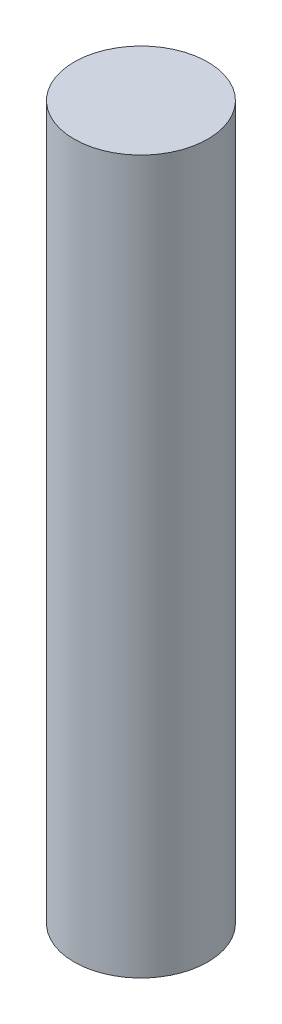
ISO-10303-21;
HEADER;
FILE_DESCRIPTION(('STEP AP214'),'2;1');
FILE_NAME('part.step','',(''),(''),'','','');
FILE_SCHEMA(('AUTOMOTIVE_DESIGN { 1 0 10303 214 1 1 1 1 }'));
ENDSEC;
DATA;
#1=APPLICATION_CONTEXT('core data for automotive mechanical design processes');
#2=APPLICATION_PROTOCOL_DEFINITION('international standard','automotive_design',2000,#1);
#3=PRODUCT_CONTEXT('',#1,'mechanical');
#4=PRODUCT('Part','Part','',(#3));
#5=PRODUCT_RELATED_PRODUCT_CATEGORY('part','',(#4));
#6=PRODUCT_DEFINITION_FORMATION('','',#4);
#7=PRODUCT_DEFINITION_CONTEXT('part definition',#1,'design');
#8=PRODUCT_DEFINITION('design','',#6,#7);
#9=PRODUCT_DEFINITION_SHAPE('','',#8);
#10=(LENGTH_UNIT() NAMED_UNIT(*) SI_UNIT(.MILLI.,.METRE.));
#11=(NAMED_UNIT(*) PLANE_ANGLE_UNIT() SI_UNIT($,.RADIAN.));
#12=(NAMED_UNIT(*) SI_UNIT($,.STERADIAN.) SOLID_ANGLE_UNIT());
#13=UNCERTAINTY_MEASURE_WITH_UNIT(LENGTH_MEASURE(1.E-05),#10,'distance_accuracy_value','');
#14=(GEOMETRIC_REPRESENTATION_CONTEXT(3) GLOBAL_UNCERTAINTY_ASSIGNED_CONTEXT((#13)) GLOBAL_UNIT_ASSIGNED_CONTEXT((#10,
#11,#12)) REPRESENTATION_CONTEXT('',''));
#15=CARTESIAN_POINT('',(0.,0.,0.));
#16=DIRECTION('',(0.,0.,1.));
#17=DIRECTION('',(1.,0.,0.));
#18=AXIS2_PLACEMENT_3D('',#15,#16,#17);
#19=CARTESIAN_POINT('',(0.,50.8,0.));
#20=DIRECTION('',(0.,-1.,0.));
#21=DIRECTION('',(0.,0.,-1.));
#22=AXIS2_PLACEMENT_3D('',#19,#20,#21);
#23=CYLINDRICAL_SURFACE('',#22,4.7625);
#24=CARTESIAN_POINT('',(0.,50.8,0.));
#25=DIRECTION('',(0.,1.,0.));
#26=DIRECTION('',(0.,0.,1.));
#27=AXIS2_PLACEMENT_3D('',#24,#25,#26);
#28=CIRCLE('',#27,4.7625);
#29=CARTESIAN_POINT('',(0.,50.8,4.7625));
#30=VERTEX_POINT('',#29);
#31=EDGE_CURVE('E10',#30,#30,#28,.T.);
#32=ORIENTED_EDGE('',*,*,#31,.F.);
#33=EDGE_LOOP('',(#32));
#34=FACE_BOUND('',#33,.T.);
#35=CARTESIAN_POINT('',(0.,0.,0.));
#36=DIRECTION('',(0.,1.,0.));
#37=DIRECTION('',(0.,0.,1.));
#38=AXIS2_PLACEMENT_3D('',#35,#36,#37);
#39=CIRCLE('',#38,4.7625);
#40=CARTESIAN_POINT('',(0.,0.,4.7625));
#41=VERTEX_POINT('',#40);
#42=EDGE_CURVE('E34',#41,#41,#39,.T.);
#43=ORIENTED_EDGE('',*,*,#42,.T.);
#44=EDGE_LOOP('',(#43));
#45=FACE_BOUND('',#44,.T.);
#46=ADVANCED_FACE('F31',(#34,#45),#23,.T.);
#47=CARTESIAN_POINT('',(0.,50.8,0.));
#48=DIRECTION('',(0.,1.,0.));
#49=DIRECTION('',(0.,0.,1.));
#50=AXIS2_PLACEMENT_3D('',#47,#48,#49);
#51=PLANE('',#50);
#52=ORIENTED_EDGE('',*,*,#31,.T.);
#53=EDGE_LOOP('',(#52));
#54=FACE_BOUND('',#53,.T.);
#55=ADVANCED_FACE('F46',(#54),#51,.T.);
#56=CARTESIAN_POINT('',(0.,0.,0.));
#57=DIRECTION('',(0.,1.,0.));
#58=DIRECTION('',(0.,0.,1.));
#59=AXIS2_PLACEMENT_3D('',#56,#57,#58);
#60=PLANE('',#59);
#61=ORIENTED_EDGE('',*,*,#42,.F.);
#62=EDGE_LOOP('',(#61));
#63=FACE_BOUND('',#62,.T.);
#64=ADVANCED_FACE('F44',(#63),#60,.F.);
#65=CLOSED_SHELL('',(#46,#55,#64));
#66=MANIFOLD_SOLID_BREP('B2',#65);
#67=ADVANCED_BREP_SHAPE_REPRESENTATION('',(#18,#66),#14);
#68=SHAPE_DEFINITION_REPRESENTATION(#9,#67);
ENDSEC;
END-ISO-10303-21;
